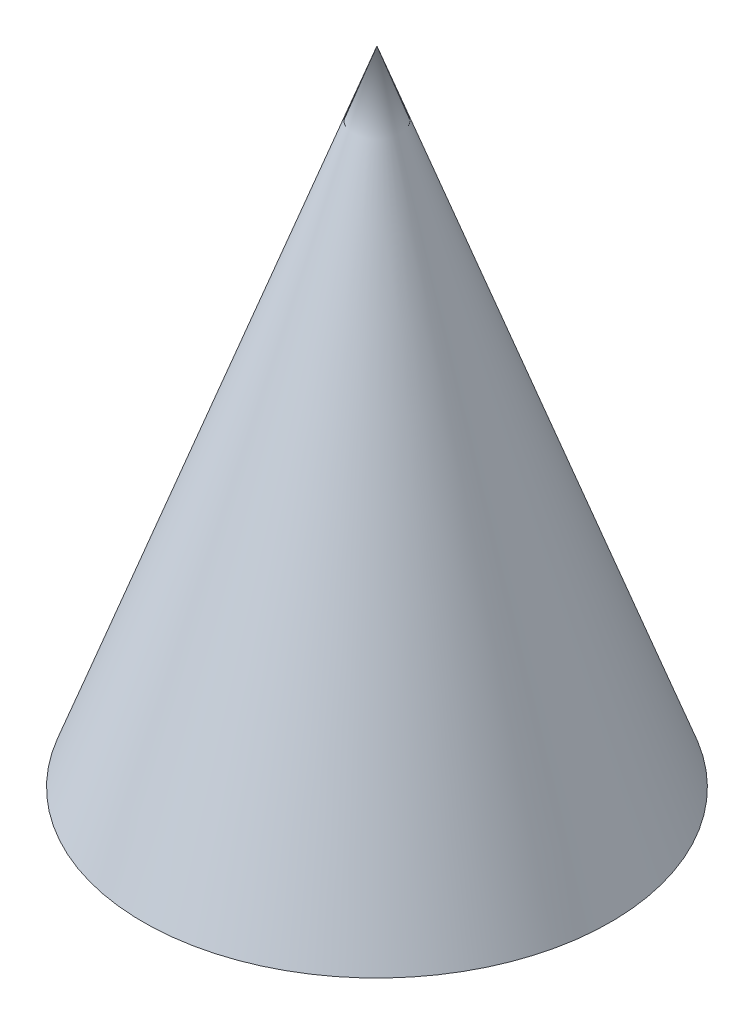
ISO-10303-21;
HEADER;
FILE_DESCRIPTION(('STEP AP214'),'2;1');
FILE_NAME('part.step','',(''),(''),'','','');
FILE_SCHEMA(('AUTOMOTIVE_DESIGN { 1 0 10303 214 1 1 1 1 }'));
ENDSEC;
DATA;
#1=APPLICATION_CONTEXT('core data for automotive mechanical design processes');
#2=APPLICATION_PROTOCOL_DEFINITION('international standard','automotive_design',2000,#1);
#3=PRODUCT_CONTEXT('',#1,'mechanical');
#4=PRODUCT('Part','Part','',(#3));
#5=PRODUCT_RELATED_PRODUCT_CATEGORY('part','',(#4));
#6=PRODUCT_DEFINITION_FORMATION('','',#4);
#7=PRODUCT_DEFINITION_CONTEXT('part definition',#1,'design');
#8=PRODUCT_DEFINITION('design','',#6,#7);
#9=PRODUCT_DEFINITION_SHAPE('','',#8);
#10=(LENGTH_UNIT() NAMED_UNIT(*) SI_UNIT(.MILLI.,.METRE.));
#11=(NAMED_UNIT(*) PLANE_ANGLE_UNIT() SI_UNIT($,.RADIAN.));
#12=(NAMED_UNIT(*) SI_UNIT($,.STERADIAN.) SOLID_ANGLE_UNIT());
#13=UNCERTAINTY_MEASURE_WITH_UNIT(LENGTH_MEASURE(1.E-05),#10,'distance_accuracy_value','');
#14=(GEOMETRIC_REPRESENTATION_CONTEXT(3) GLOBAL_UNCERTAINTY_ASSIGNED_CONTEXT((#13)) GLOBAL_UNIT_ASSIGNED_CONTEXT((#10,
#11,#12)) REPRESENTATION_CONTEXT('',''));
#15=CARTESIAN_POINT('',(0.,0.,0.));
#16=DIRECTION('',(0.,0.,1.));
#17=DIRECTION('',(1.,0.,0.));
#18=AXIS2_PLACEMENT_3D('',#15,#16,#17);
#19=CARTESIAN_POINT('',(0.,0.,0.));
#20=DIRECTION('',(0.,-1.,0.));
#21=DIRECTION('',(-0.866025403784443,0.,0.499999999999992));
#22=AXIS2_PLACEMENT_3D('',#19,#20,#21);
#23=PLANE('',#22);
#24=CARTESIAN_POINT('',(0.,0.,0.));
#25=DIRECTION('',(0.,-1.,0.));
#26=DIRECTION('',(0.,0.,-1.));
#27=AXIS2_PLACEMENT_3D('',#24,#25,#26);
#28=CIRCLE('',#27,20.);
#29=CARTESIAN_POINT('',(17.3205080756887,0.,10.0000000000001));
#30=VERTEX_POINT('',#29);
#31=CARTESIAN_POINT('',(-17.3205080756889,0.,9.99999999999984));
#32=VERTEX_POINT('',#31);
#33=EDGE_CURVE('E77',#30,#32,#28,.T.);
#34=ORIENTED_EDGE('',*,*,#33,.T.);
#35=CARTESIAN_POINT('',(0.,0.,0.));
#36=DIRECTION('',(0.,-1.,0.));
#37=DIRECTION('',(0.,0.,-1.));
#38=AXIS2_PLACEMENT_3D('',#35,#36,#37);
#39=CIRCLE('',#38,20.);
#40=CARTESIAN_POINT('',(0.,0.,-20.));
#41=VERTEX_POINT('',#40);
#42=EDGE_CURVE('E11',#32,#41,#39,.T.);
#43=ORIENTED_EDGE('',*,*,#42,.T.);
#44=CARTESIAN_POINT('',(0.,0.,0.));
#45=DIRECTION('',(0.,-1.,0.));
#46=DIRECTION('',(0.,0.,-1.));
#47=AXIS2_PLACEMENT_3D('',#44,#45,#46);
#48=CIRCLE('',#47,20.);
#49=EDGE_CURVE('E46',#41,#30,#48,.T.);
#50=ORIENTED_EDGE('',*,*,#49,.T.);
#51=EDGE_LOOP('',(#34,#43,#50));
#52=FACE_BOUND('',#51,.T.);
#53=ADVANCED_FACE('F37',(#52),#23,.T.);
#54=CARTESIAN_POINT('',(0.,0.,0.));
#55=DIRECTION('',(0.,-1.,0.));
#56=DIRECTION('',(0.,0.,-1.));
#57=AXIS2_PLACEMENT_3D('',#54,#55,#56);
#58=CONICAL_SURFACE('',#57,20.,0.349065850398867);
#59=DIRECTION('',(0.296198132726024,-0.939692620785908,0.171010071662836));
#60=VECTOR('',#59,1.);
#61=CARTESIAN_POINT('',(17.3205080756887,0.,10.0000000000001));
#62=LINE('',#61,#60);
#63=CARTESIAN_POINT('',(4.71220931185255,40.,2.72059531467596));
#64=VERTEX_POINT('',#63);
#65=EDGE_CURVE('E75',#64,#30,#62,.T.);
#66=ORIENTED_EDGE('',*,*,#65,.T.);
#67=ORIENTED_EDGE('',*,*,#49,.F.);
#68=DIRECTION('',(0.,-0.939692620785908,-0.342020143325669));
#69=VECTOR('',#68,1.);
#70=CARTESIAN_POINT('',(0.,0.,-20.));
#71=LINE('',#70,#69);
#72=CARTESIAN_POINT('',(0.,40.,-5.44119062935187));
#73=VERTEX_POINT('',#72);
#74=EDGE_CURVE('E71',#73,#41,#71,.T.);
#75=ORIENTED_EDGE('',*,*,#74,.F.);
#76=ORIENTED_EDGE('',*,*,#74,.T.);
#77=ORIENTED_EDGE('',*,*,#42,.F.);
#78=DIRECTION('',(-0.296198132726026,-0.939692620785908,0.171010071662832));
#79=VECTOR('',#78,1.);
#80=CARTESIAN_POINT('',(-17.3205080756889,0.,9.99999999999984));
#81=LINE('',#80,#79);
#82=CARTESIAN_POINT('',(-4.71220931185258,40.,2.72059531467589));
#83=VERTEX_POINT('',#82);
#84=EDGE_CURVE('E41',#32,#83,#81,.F.);
#85=ORIENTED_EDGE('',*,*,#84,.T.);
#86=ORIENTED_EDGE('',*,*,#84,.F.);
#87=ORIENTED_EDGE('',*,*,#33,.F.);
#88=ORIENTED_EDGE('',*,*,#65,.F.);
#89=EDGE_LOOP('',(#66,#67,#75,#76,#77,#85,#86,#87,#88));
#90=FACE_BOUND('',#89,.T.);
#91=CARTESIAN_POINT('',(0.,54.9495483890923,0.));
#92=VERTEX_POINT('',#91);
#93=VERTEX_LOOP('',#92);
#94=FACE_BOUND('',#93,.T.);
#95=ADVANCED_FACE('F39',(#90,#94),#58,.T.);
#96=CLOSED_SHELL('',(#53,#95));
#97=MANIFOLD_SOLID_BREP('B2',#96);
#98=ADVANCED_BREP_SHAPE_REPRESENTATION('',(#18,#97),#14);
#99=SHAPE_DEFINITION_REPRESENTATION(#9,#98);
ENDSEC;
END-ISO-10303-21;
